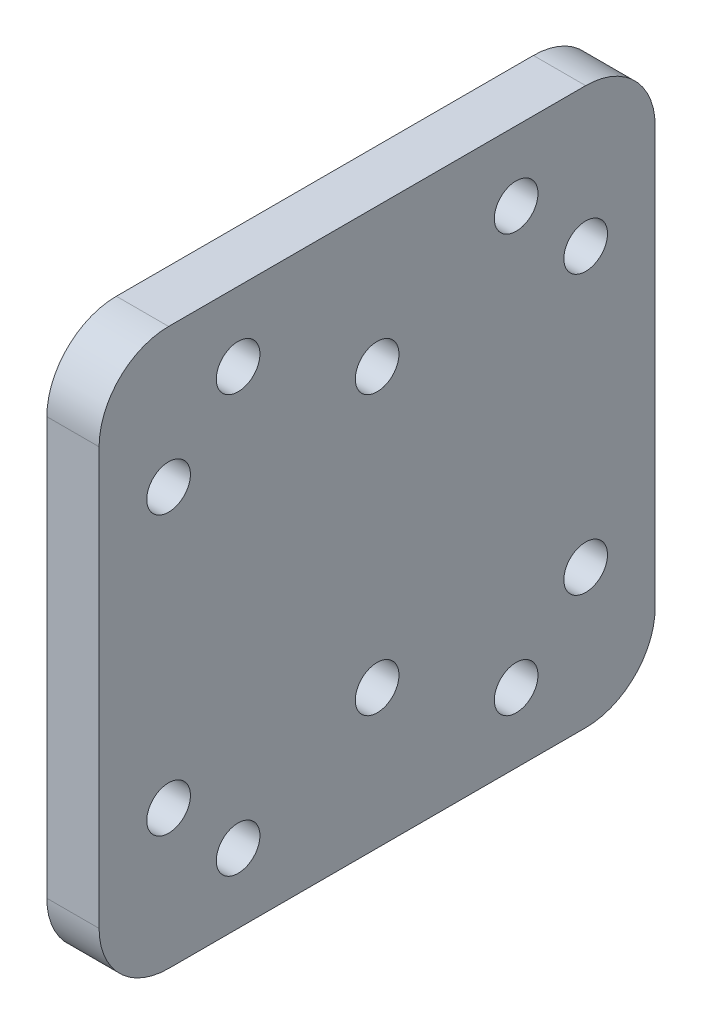
ISO-10303-21;
HEADER;
FILE_DESCRIPTION(('STEP AP214'),'2;1');
FILE_NAME('part.step','',(''),(''),'','','');
FILE_SCHEMA(('AUTOMOTIVE_DESIGN { 1 0 10303 214 1 1 1 1 }'));
ENDSEC;
DATA;
#1=APPLICATION_CONTEXT('core data for automotive mechanical design processes');
#2=APPLICATION_PROTOCOL_DEFINITION('international standard','automotive_design',2000,#1);
#3=PRODUCT_CONTEXT('',#1,'mechanical');
#4=PRODUCT('Part','Part','',(#3));
#5=PRODUCT_RELATED_PRODUCT_CATEGORY('part','',(#4));
#6=PRODUCT_DEFINITION_FORMATION('','',#4);
#7=PRODUCT_DEFINITION_CONTEXT('part definition',#1,'design');
#8=PRODUCT_DEFINITION('design','',#6,#7);
#9=PRODUCT_DEFINITION_SHAPE('','',#8);
#10=(LENGTH_UNIT() NAMED_UNIT(*) SI_UNIT(.MILLI.,.METRE.));
#11=(NAMED_UNIT(*) PLANE_ANGLE_UNIT() SI_UNIT($,.RADIAN.));
#12=(NAMED_UNIT(*) SI_UNIT($,.STERADIAN.) SOLID_ANGLE_UNIT());
#13=UNCERTAINTY_MEASURE_WITH_UNIT(LENGTH_MEASURE(1.E-05),#10,'distance_accuracy_value','');
#14=(GEOMETRIC_REPRESENTATION_CONTEXT(3) GLOBAL_UNCERTAINTY_ASSIGNED_CONTEXT((#13)) GLOBAL_UNIT_ASSIGNED_CONTEXT((#10,
#11,#12)) REPRESENTATION_CONTEXT('',''));
#15=CARTESIAN_POINT('',(0.,0.,0.));
#16=DIRECTION('',(0.,0.,1.));
#17=DIRECTION('',(1.,0.,0.));
#18=AXIS2_PLACEMENT_3D('',#15,#16,#17);
#19=CARTESIAN_POINT('',(0.,0.,-50.8));
#20=DIRECTION('',(0.,0.,-1.));
#21=DIRECTION('',(-1.,0.,0.));
#22=AXIS2_PLACEMENT_3D('',#19,#20,#21);
#23=PLANE('',#22);
#24=DIRECTION('',(1.,0.,0.));
#25=VECTOR('',#24,1.);
#26=CARTESIAN_POINT('',(2.3876,12.7,-50.8));
#27=LINE('',#26,#25);
#28=CARTESIAN_POINT('',(0.,12.7,-50.8));
#29=VERTEX_POINT('',#28);
#30=CARTESIAN_POINT('',(4.7752,12.7,-50.8));
#31=VERTEX_POINT('',#30);
#32=EDGE_CURVE('E211',#29,#31,#27,.T.);
#33=ORIENTED_EDGE('',*,*,#32,.F.);
#34=DIRECTION('',(0.,1.,0.));
#35=VECTOR('',#34,1.);
#36=CARTESIAN_POINT('',(0.,0.,-50.8));
#37=LINE('',#36,#35);
#38=CARTESIAN_POINT('',(0.,50.8,-50.8));
#39=VERTEX_POINT('',#38);
#40=EDGE_CURVE('E208',#29,#39,#37,.T.);
#41=ORIENTED_EDGE('',*,*,#40,.T.);
#42=DIRECTION('',(-1.,0.,0.));
#43=VECTOR('',#42,1.);
#44=CARTESIAN_POINT('',(2.3876,50.8,-50.8));
#45=LINE('',#44,#43);
#46=CARTESIAN_POINT('',(4.7752,50.8,-50.8));
#47=VERTEX_POINT('',#46);
#48=EDGE_CURVE('E321',#47,#39,#45,.T.);
#49=ORIENTED_EDGE('',*,*,#48,.F.);
#50=DIRECTION('',(0.,1.,0.));
#51=VECTOR('',#50,1.);
#52=CARTESIAN_POINT('',(4.7752,0.,-50.8));
#53=LINE('',#52,#51);
#54=EDGE_CURVE('E194',#31,#47,#53,.T.);
#55=ORIENTED_EDGE('',*,*,#54,.F.);
#56=EDGE_LOOP('',(#33,#41,#49,#55));
#57=FACE_BOUND('',#56,.T.);
#58=ADVANCED_FACE('F17',(#57),#23,.T.);
#59=CARTESIAN_POINT('',(0.,44.45,-25.4));
#60=DIRECTION('',(1.,0.,0.));
#61=DIRECTION('',(0.,-1.,0.));
#62=AXIS2_PLACEMENT_3D('',#59,#60,#61);
#63=CYLINDRICAL_SURFACE('',#62,1.9939);
#64=CARTESIAN_POINT('',(4.7752,44.45,-25.4));
#65=DIRECTION('',(-1.,0.,0.));
#66=DIRECTION('',(0.,-1.,0.));
#67=AXIS2_PLACEMENT_3D('',#64,#65,#66);
#68=CIRCLE('',#67,1.9939);
#69=CARTESIAN_POINT('',(4.7752,46.4439,-25.4));
#70=VERTEX_POINT('',#69);
#71=EDGE_CURVE('E278',#70,#70,#68,.T.);
#72=ORIENTED_EDGE('',*,*,#71,.F.);
#73=DIRECTION('',(-1.,0.,0.));
#74=VECTOR('',#73,1.);
#75=CARTESIAN_POINT('',(0.,46.4439,-25.4));
#76=LINE('',#75,#74);
#77=CARTESIAN_POINT('',(0.,46.4439,-25.4));
#78=VERTEX_POINT('',#77);
#79=EDGE_CURVE('E11',#70,#78,#76,.T.);
#80=ORIENTED_EDGE('',*,*,#79,.T.);
#81=CARTESIAN_POINT('',(0.,44.45,-25.4));
#82=DIRECTION('',(-1.,0.,0.));
#83=DIRECTION('',(0.,-1.,0.));
#84=AXIS2_PLACEMENT_3D('',#81,#82,#83);
#85=CIRCLE('',#84,1.9939);
#86=EDGE_CURVE('E282',#78,#78,#85,.T.);
#87=ORIENTED_EDGE('',*,*,#86,.T.);
#88=ORIENTED_EDGE('',*,*,#79,.F.);
#89=EDGE_LOOP('',(#72,#80,#87,#88));
#90=FACE_BOUND('',#89,.T.);
#91=ADVANCED_FACE('F582',(#90),#63,.F.);
#92=CARTESIAN_POINT('',(0.,44.45,-44.45));
#93=DIRECTION('',(1.,0.,0.));
#94=DIRECTION('',(0.,-1.,0.));
#95=AXIS2_PLACEMENT_3D('',#92,#93,#94);
#96=CYLINDRICAL_SURFACE('',#95,1.9939);
#97=CARTESIAN_POINT('',(4.7752,44.45,-44.45));
#98=DIRECTION('',(-1.,0.,0.));
#99=DIRECTION('',(0.,-1.,0.));
#100=AXIS2_PLACEMENT_3D('',#97,#98,#99);
#101=CIRCLE('',#100,1.9939);
#102=CARTESIAN_POINT('',(4.7752,46.4439,-44.45));
#103=VERTEX_POINT('',#102);
#104=EDGE_CURVE('E243',#103,#103,#101,.T.);
#105=ORIENTED_EDGE('',*,*,#104,.F.);
#106=DIRECTION('',(-1.,0.,0.));
#107=VECTOR('',#106,1.);
#108=CARTESIAN_POINT('',(0.,46.4439,-44.45));
#109=LINE('',#108,#107);
#110=CARTESIAN_POINT('',(0.,46.4439,-44.45));
#111=VERTEX_POINT('',#110);
#112=EDGE_CURVE('E25',#103,#111,#109,.T.);
#113=ORIENTED_EDGE('',*,*,#112,.T.);
#114=CARTESIAN_POINT('',(0.,44.45,-44.45));
#115=DIRECTION('',(-1.,0.,0.));
#116=DIRECTION('',(0.,-1.,0.));
#117=AXIS2_PLACEMENT_3D('',#114,#115,#116);
#118=CIRCLE('',#117,1.9939);
#119=EDGE_CURVE('E279',#111,#111,#118,.T.);
#120=ORIENTED_EDGE('',*,*,#119,.T.);
#121=ORIENTED_EDGE('',*,*,#112,.F.);
#122=EDGE_LOOP('',(#105,#113,#120,#121));
#123=FACE_BOUND('',#122,.T.);
#124=ADVANCED_FACE('F587',(#123),#96,.F.);
#125=CARTESIAN_POINT('',(0.,19.05,-44.45));
#126=DIRECTION('',(1.,0.,0.));
#127=DIRECTION('',(0.,-1.,0.));
#128=AXIS2_PLACEMENT_3D('',#125,#126,#127);
#129=CYLINDRICAL_SURFACE('',#128,1.9939);
#130=CARTESIAN_POINT('',(4.7752,19.05,-44.45));
#131=DIRECTION('',(-1.,0.,0.));
#132=DIRECTION('',(0.,-1.,0.));
#133=AXIS2_PLACEMENT_3D('',#130,#131,#132);
#134=CIRCLE('',#133,1.9939);
#135=CARTESIAN_POINT('',(4.7752,21.0439,-44.45));
#136=VERTEX_POINT('',#135);
#137=EDGE_CURVE('E238',#136,#136,#134,.T.);
#138=ORIENTED_EDGE('',*,*,#137,.F.);
#139=DIRECTION('',(-1.,0.,0.));
#140=VECTOR('',#139,1.);
#141=CARTESIAN_POINT('',(0.,21.0439,-44.45));
#142=LINE('',#141,#140);
#143=CARTESIAN_POINT('',(0.,21.0439,-44.45));
#144=VERTEX_POINT('',#143);
#145=EDGE_CURVE('E381',#136,#144,#142,.T.);
#146=ORIENTED_EDGE('',*,*,#145,.T.);
#147=CARTESIAN_POINT('',(0.,19.05,-44.45));
#148=DIRECTION('',(-1.,0.,0.));
#149=DIRECTION('',(0.,-1.,0.));
#150=AXIS2_PLACEMENT_3D('',#147,#148,#149);
#151=CIRCLE('',#150,1.9939);
#152=EDGE_CURVE('E283',#144,#144,#151,.T.);
#153=ORIENTED_EDGE('',*,*,#152,.T.);
#154=ORIENTED_EDGE('',*,*,#145,.F.);
#155=EDGE_LOOP('',(#138,#146,#153,#154));
#156=FACE_BOUND('',#155,.T.);
#157=ADVANCED_FACE('F592',(#156),#129,.F.);
#158=CARTESIAN_POINT('',(0.,44.45,-6.35));
#159=DIRECTION('',(1.,0.,0.));
#160=DIRECTION('',(0.,-1.,0.));
#161=AXIS2_PLACEMENT_3D('',#158,#159,#160);
#162=CYLINDRICAL_SURFACE('',#161,1.9939);
#163=CARTESIAN_POINT('',(4.7752,44.45,-6.35));
#164=DIRECTION('',(-1.,0.,0.));
#165=DIRECTION('',(0.,-1.,0.));
#166=AXIS2_PLACEMENT_3D('',#163,#164,#165);
#167=CIRCLE('',#166,1.9939);
#168=CARTESIAN_POINT('',(4.7752,46.4439,-6.35));
#169=VERTEX_POINT('',#168);
#170=EDGE_CURVE('E242',#169,#169,#167,.T.);
#171=ORIENTED_EDGE('',*,*,#170,.F.);
#172=DIRECTION('',(-1.,0.,0.));
#173=VECTOR('',#172,1.);
#174=CARTESIAN_POINT('',(0.,46.4439,-6.35));
#175=LINE('',#174,#173);
#176=CARTESIAN_POINT('',(0.,46.4439,-6.35));
#177=VERTEX_POINT('',#176);
#178=EDGE_CURVE('E378',#169,#177,#175,.T.);
#179=ORIENTED_EDGE('',*,*,#178,.T.);
#180=CARTESIAN_POINT('',(0.,44.45,-6.35));
#181=DIRECTION('',(-1.,0.,0.));
#182=DIRECTION('',(0.,-1.,0.));
#183=AXIS2_PLACEMENT_3D('',#180,#181,#182);
#184=CIRCLE('',#183,1.9939);
#185=EDGE_CURVE('E363',#177,#177,#184,.T.);
#186=ORIENTED_EDGE('',*,*,#185,.T.);
#187=ORIENTED_EDGE('',*,*,#178,.F.);
#188=EDGE_LOOP('',(#171,#179,#186,#187));
#189=FACE_BOUND('',#188,.T.);
#190=ADVANCED_FACE('F596',(#189),#162,.F.);
#191=CARTESIAN_POINT('',(0.,19.05,-6.35));
#192=DIRECTION('',(1.,0.,0.));
#193=DIRECTION('',(0.,-1.,0.));
#194=AXIS2_PLACEMENT_3D('',#191,#192,#193);
#195=CYLINDRICAL_SURFACE('',#194,1.9939);
#196=CARTESIAN_POINT('',(4.7752,19.05,-6.35));
#197=DIRECTION('',(-1.,0.,0.));
#198=DIRECTION('',(0.,-1.,0.));
#199=AXIS2_PLACEMENT_3D('',#196,#197,#198);
#200=CIRCLE('',#199,1.9939);
#201=CARTESIAN_POINT('',(4.7752,21.0439,-6.35));
#202=VERTEX_POINT('',#201);
#203=EDGE_CURVE('E298',#202,#202,#200,.T.);
#204=ORIENTED_EDGE('',*,*,#203,.F.);
#205=DIRECTION('',(-1.,0.,0.));
#206=VECTOR('',#205,1.);
#207=CARTESIAN_POINT('',(0.,21.0439,-6.35));
#208=LINE('',#207,#206);
#209=CARTESIAN_POINT('',(0.,21.0439,-6.35));
#210=VERTEX_POINT('',#209);
#211=EDGE_CURVE('E293',#202,#210,#208,.T.);
#212=ORIENTED_EDGE('',*,*,#211,.T.);
#213=CARTESIAN_POINT('',(0.,19.05,-6.35));
#214=DIRECTION('',(-1.,0.,0.));
#215=DIRECTION('',(0.,-1.,0.));
#216=AXIS2_PLACEMENT_3D('',#213,#214,#215);
#217=CIRCLE('',#216,1.9939);
#218=EDGE_CURVE('E337',#210,#210,#217,.T.);
#219=ORIENTED_EDGE('',*,*,#218,.T.);
#220=ORIENTED_EDGE('',*,*,#211,.F.);
#221=EDGE_LOOP('',(#204,#212,#219,#220));
#222=FACE_BOUND('',#221,.T.);
#223=ADVANCED_FACE('F602',(#222),#195,.F.);
#224=CARTESIAN_POINT('',(0.,50.8,-38.1));
#225=DIRECTION('',(1.,0.,0.));
#226=DIRECTION('',(0.,-1.,0.));
#227=AXIS2_PLACEMENT_3D('',#224,#225,#226);
#228=CYLINDRICAL_SURFACE('',#227,1.9939);
#229=CARTESIAN_POINT('',(4.7752,50.8,-38.1));
#230=DIRECTION('',(-1.,0.,0.));
#231=DIRECTION('',(0.,-1.,0.));
#232=AXIS2_PLACEMENT_3D('',#229,#230,#231);
#233=CIRCLE('',#232,1.9939);
#234=CARTESIAN_POINT('',(4.7752,52.7939,-38.1));
#235=VERTEX_POINT('',#234);
#236=EDGE_CURVE('E302',#235,#235,#233,.T.);
#237=ORIENTED_EDGE('',*,*,#236,.F.);
#238=DIRECTION('',(-1.,0.,0.));
#239=VECTOR('',#238,1.);
#240=CARTESIAN_POINT('',(0.,52.7939,-38.1));
#241=LINE('',#240,#239);
#242=CARTESIAN_POINT('',(0.,52.7939,-38.1));
#243=VERTEX_POINT('',#242);
#244=EDGE_CURVE('E290',#235,#243,#241,.T.);
#245=ORIENTED_EDGE('',*,*,#244,.T.);
#246=CARTESIAN_POINT('',(0.,50.8,-38.1));
#247=DIRECTION('',(-1.,0.,0.));
#248=DIRECTION('',(0.,-1.,0.));
#249=AXIS2_PLACEMENT_3D('',#246,#247,#248);
#250=CIRCLE('',#249,1.9939);
#251=EDGE_CURVE('E333',#243,#243,#250,.T.);
#252=ORIENTED_EDGE('',*,*,#251,.T.);
#253=ORIENTED_EDGE('',*,*,#244,.F.);
#254=EDGE_LOOP('',(#237,#245,#252,#253));
#255=FACE_BOUND('',#254,.T.);
#256=ADVANCED_FACE('F598',(#255),#228,.F.);
#257=CARTESIAN_POINT('',(0.,12.7,-38.1));
#258=DIRECTION('',(1.,0.,0.));
#259=DIRECTION('',(0.,-1.,0.));
#260=AXIS2_PLACEMENT_3D('',#257,#258,#259);
#261=CYLINDRICAL_SURFACE('',#260,1.9939);
#262=CARTESIAN_POINT('',(4.7752,12.7,-38.1));
#263=DIRECTION('',(-1.,0.,0.));
#264=DIRECTION('',(0.,-1.,0.));
#265=AXIS2_PLACEMENT_3D('',#262,#263,#264);
#266=CIRCLE('',#265,1.9939);
#267=CARTESIAN_POINT('',(4.7752,14.6939,-38.1));
#268=VERTEX_POINT('',#267);
#269=EDGE_CURVE('E311',#268,#268,#266,.T.);
#270=ORIENTED_EDGE('',*,*,#269,.F.);
#271=DIRECTION('',(-1.,0.,0.));
#272=VECTOR('',#271,1.);
#273=CARTESIAN_POINT('',(0.,14.6939,-38.1));
#274=LINE('',#273,#272);
#275=CARTESIAN_POINT('',(0.,14.6939,-38.1));
#276=VERTEX_POINT('',#275);
#277=EDGE_CURVE('E294',#268,#276,#274,.T.);
#278=ORIENTED_EDGE('',*,*,#277,.T.);
#279=CARTESIAN_POINT('',(0.,12.7,-38.1));
#280=DIRECTION('',(-1.,0.,0.));
#281=DIRECTION('',(0.,-1.,0.));
#282=AXIS2_PLACEMENT_3D('',#279,#280,#281);
#283=CIRCLE('',#282,1.9939);
#284=EDGE_CURVE('E338',#276,#276,#283,.T.);
#285=ORIENTED_EDGE('',*,*,#284,.T.);
#286=ORIENTED_EDGE('',*,*,#277,.F.);
#287=EDGE_LOOP('',(#270,#278,#285,#286));
#288=FACE_BOUND('',#287,.T.);
#289=ADVANCED_FACE('F601',(#288),#261,.F.);
#290=CARTESIAN_POINT('',(0.,50.8,-12.7));
#291=DIRECTION('',(1.,0.,0.));
#292=DIRECTION('',(0.,-1.,0.));
#293=AXIS2_PLACEMENT_3D('',#290,#291,#292);
#294=CYLINDRICAL_SURFACE('',#293,1.9939);
#295=CARTESIAN_POINT('',(4.7752,50.8,-12.7));
#296=DIRECTION('',(-1.,0.,0.));
#297=DIRECTION('',(0.,-1.,0.));
#298=AXIS2_PLACEMENT_3D('',#295,#296,#297);
#299=CIRCLE('',#298,1.9939);
#300=CARTESIAN_POINT('',(4.7752,52.7939,-12.7));
#301=VERTEX_POINT('',#300);
#302=EDGE_CURVE('E273',#301,#301,#299,.T.);
#303=ORIENTED_EDGE('',*,*,#302,.F.);
#304=DIRECTION('',(-1.,0.,0.));
#305=VECTOR('',#304,1.);
#306=CARTESIAN_POINT('',(0.,52.7939,-12.7));
#307=LINE('',#306,#305);
#308=CARTESIAN_POINT('',(0.,52.7939,-12.7));
#309=VERTEX_POINT('',#308);
#310=EDGE_CURVE('E267',#301,#309,#307,.T.);
#311=ORIENTED_EDGE('',*,*,#310,.T.);
#312=CARTESIAN_POINT('',(0.,50.8,-12.7));
#313=DIRECTION('',(-1.,0.,0.));
#314=DIRECTION('',(0.,-1.,0.));
#315=AXIS2_PLACEMENT_3D('',#312,#313,#314);
#316=CIRCLE('',#315,1.9939);
#317=EDGE_CURVE('E307',#309,#309,#316,.T.);
#318=ORIENTED_EDGE('',*,*,#317,.T.);
#319=ORIENTED_EDGE('',*,*,#310,.F.);
#320=EDGE_LOOP('',(#303,#311,#318,#319));
#321=FACE_BOUND('',#320,.T.);
#322=ADVANCED_FACE('F606',(#321),#294,.F.);
#323=CARTESIAN_POINT('',(0.,12.7,-12.7));
#324=DIRECTION('',(1.,0.,0.));
#325=DIRECTION('',(0.,-1.,0.));
#326=AXIS2_PLACEMENT_3D('',#323,#324,#325);
#327=CYLINDRICAL_SURFACE('',#326,1.9939);
#328=CARTESIAN_POINT('',(4.7752,12.7,-12.7));
#329=DIRECTION('',(-1.,0.,0.));
#330=DIRECTION('',(0.,-1.,0.));
#331=AXIS2_PLACEMENT_3D('',#328,#329,#330);
#332=CIRCLE('',#331,1.9939);
#333=CARTESIAN_POINT('',(4.7752,14.6939,-12.7));
#334=VERTEX_POINT('',#333);
#335=EDGE_CURVE('E268',#334,#334,#332,.T.);
#336=ORIENTED_EDGE('',*,*,#335,.F.);
#337=DIRECTION('',(-1.,0.,0.));
#338=VECTOR('',#337,1.);
#339=CARTESIAN_POINT('',(0.,14.6939,-12.7));
#340=LINE('',#339,#338);
#341=CARTESIAN_POINT('',(0.,14.6939,-12.7));
#342=VERTEX_POINT('',#341);
#343=EDGE_CURVE('E264',#334,#342,#340,.T.);
#344=ORIENTED_EDGE('',*,*,#343,.T.);
#345=CARTESIAN_POINT('',(0.,12.7,-12.7));
#346=DIRECTION('',(-1.,0.,0.));
#347=DIRECTION('',(0.,-1.,0.));
#348=AXIS2_PLACEMENT_3D('',#345,#346,#347);
#349=CIRCLE('',#348,1.9939);
#350=EDGE_CURVE('E303',#342,#342,#349,.T.);
#351=ORIENTED_EDGE('',*,*,#350,.T.);
#352=ORIENTED_EDGE('',*,*,#343,.F.);
#353=EDGE_LOOP('',(#336,#344,#351,#352));
#354=FACE_BOUND('',#353,.T.);
#355=ADVANCED_FACE('F613',(#354),#327,.F.);
#356=CARTESIAN_POINT('',(0.,19.05,-25.4));
#357=DIRECTION('',(1.,0.,0.));
#358=DIRECTION('',(0.,-1.,0.));
#359=AXIS2_PLACEMENT_3D('',#356,#357,#358);
#360=CYLINDRICAL_SURFACE('',#359,1.9939);
#361=CARTESIAN_POINT('',(4.7752,19.05,-25.4));
#362=DIRECTION('',(-1.,0.,0.));
#363=DIRECTION('',(0.,-1.,0.));
#364=AXIS2_PLACEMENT_3D('',#361,#362,#363);
#365=CIRCLE('',#364,1.9939);
#366=CARTESIAN_POINT('',(4.7752,21.0439,-25.4));
#367=VERTEX_POINT('',#366);
#368=EDGE_CURVE('E272',#367,#367,#365,.T.);
#369=ORIENTED_EDGE('',*,*,#368,.F.);
#370=DIRECTION('',(-1.,0.,0.));
#371=VECTOR('',#370,1.);
#372=CARTESIAN_POINT('',(0.,21.0439,-25.4));
#373=LINE('',#372,#371);
#374=CARTESIAN_POINT('',(0.,21.0439,-25.4));
#375=VERTEX_POINT('',#374);
#376=EDGE_CURVE('E219',#367,#375,#373,.T.);
#377=ORIENTED_EDGE('',*,*,#376,.T.);
#378=CARTESIAN_POINT('',(0.,19.05,-25.4));
#379=DIRECTION('',(-1.,0.,0.));
#380=DIRECTION('',(0.,-1.,0.));
#381=AXIS2_PLACEMENT_3D('',#378,#379,#380);
#382=CIRCLE('',#381,1.9939);
#383=EDGE_CURVE('E236',#375,#375,#382,.T.);
#384=ORIENTED_EDGE('',*,*,#383,.T.);
#385=ORIENTED_EDGE('',*,*,#376,.F.);
#386=EDGE_LOOP('',(#369,#377,#384,#385));
#387=FACE_BOUND('',#386,.T.);
#388=ADVANCED_FACE('F615',(#387),#360,.F.);
#389=CARTESIAN_POINT('',(0.,63.5,0.));
#390=DIRECTION('',(0.,0.,1.));
#391=DIRECTION('',(0.,-1.,0.));
#392=AXIS2_PLACEMENT_3D('',#389,#390,#391);
#393=PLANE('',#392);
#394=DIRECTION('',(1.,0.,0.));
#395=VECTOR('',#394,1.);
#396=CARTESIAN_POINT('',(2.3876,50.8,0.));
#397=LINE('',#396,#395);
#398=CARTESIAN_POINT('',(0.,50.8,0.));
#399=VERTEX_POINT('',#398);
#400=CARTESIAN_POINT('',(4.7752,50.8,0.));
#401=VERTEX_POINT('',#400);
#402=EDGE_CURVE('E227',#399,#401,#397,.T.);
#403=ORIENTED_EDGE('',*,*,#402,.F.);
#404=DIRECTION('',(0.,-1.,0.));
#405=VECTOR('',#404,1.);
#406=CARTESIAN_POINT('',(0.,63.5,0.));
#407=LINE('',#406,#405);
#408=CARTESIAN_POINT('',(0.,12.7,0.));
#409=VERTEX_POINT('',#408);
#410=EDGE_CURVE('E237',#399,#409,#407,.T.);
#411=ORIENTED_EDGE('',*,*,#410,.T.);
#412=DIRECTION('',(-1.,0.,0.));
#413=VECTOR('',#412,1.);
#414=CARTESIAN_POINT('',(2.3876,12.7,0.));
#415=LINE('',#414,#413);
#416=CARTESIAN_POINT('',(4.7752,12.7,0.));
#417=VERTEX_POINT('',#416);
#418=EDGE_CURVE('E255',#417,#409,#415,.T.);
#419=ORIENTED_EDGE('',*,*,#418,.F.);
#420=DIRECTION('',(0.,-1.,0.));
#421=VECTOR('',#420,1.);
#422=CARTESIAN_POINT('',(4.7752,63.5,0.));
#423=LINE('',#422,#421);
#424=EDGE_CURVE('E263',#401,#417,#423,.T.);
#425=ORIENTED_EDGE('',*,*,#424,.F.);
#426=EDGE_LOOP('',(#403,#411,#419,#425));
#427=FACE_BOUND('',#426,.T.);
#428=ADVANCED_FACE('F556',(#427),#393,.T.);
#429=CARTESIAN_POINT('',(0.,31.75,-25.4));
#430=DIRECTION('',(1.,0.,0.));
#431=DIRECTION('',(0.,1.,0.));
#432=AXIS2_PLACEMENT_3D('',#429,#430,#431);
#433=PLANE('',#432);
#434=ORIENTED_EDGE('',*,*,#86,.F.);
#435=EDGE_LOOP('',(#434));
#436=FACE_BOUND('',#435,.T.);
#437=ORIENTED_EDGE('',*,*,#119,.F.);
#438=EDGE_LOOP('',(#437));
#439=FACE_BOUND('',#438,.T.);
#440=ORIENTED_EDGE('',*,*,#152,.F.);
#441=EDGE_LOOP('',(#440));
#442=FACE_BOUND('',#441,.T.);
#443=ORIENTED_EDGE('',*,*,#185,.F.);
#444=EDGE_LOOP('',(#443));
#445=FACE_BOUND('',#444,.T.);
#446=ORIENTED_EDGE('',*,*,#218,.F.);
#447=EDGE_LOOP('',(#446));
#448=FACE_BOUND('',#447,.T.);
#449=ORIENTED_EDGE('',*,*,#251,.F.);
#450=EDGE_LOOP('',(#449));
#451=FACE_BOUND('',#450,.T.);
#452=ORIENTED_EDGE('',*,*,#284,.F.);
#453=EDGE_LOOP('',(#452));
#454=FACE_BOUND('',#453,.T.);
#455=ORIENTED_EDGE('',*,*,#317,.F.);
#456=EDGE_LOOP('',(#455));
#457=FACE_BOUND('',#456,.T.);
#458=ORIENTED_EDGE('',*,*,#350,.F.);
#459=EDGE_LOOP('',(#458));
#460=FACE_BOUND('',#459,.T.);
#461=ORIENTED_EDGE('',*,*,#383,.F.);
#462=EDGE_LOOP('',(#461));
#463=FACE_BOUND('',#462,.T.);
#464=CARTESIAN_POINT('',(0.,12.7,-44.45));
#465=DIRECTION('',(1.,0.,0.));
#466=DIRECTION('',(0.,-0.707106781186547,-0.707106781186548));
#467=AXIS2_PLACEMENT_3D('',#464,#465,#466);
#468=CIRCLE('',#467,6.35);
#469=CARTESIAN_POINT('',(0.,6.35,-44.45));
#470=VERTEX_POINT('',#469);
#471=EDGE_CURVE('E200',#470,#29,#468,.T.);
#472=ORIENTED_EDGE('',*,*,#471,.F.);
#473=DIRECTION('',(0.,0.,1.));
#474=VECTOR('',#473,1.);
#475=CARTESIAN_POINT('',(0.,6.35,-12.7));
#476=LINE('',#475,#474);
#477=CARTESIAN_POINT('',(0.,6.35,-6.35));
#478=VERTEX_POINT('',#477);
#479=EDGE_CURVE('E182',#470,#478,#476,.T.);
#480=ORIENTED_EDGE('',*,*,#479,.T.);
#481=CARTESIAN_POINT('',(0.,12.7,-6.35));
#482=DIRECTION('',(1.,0.,0.));
#483=DIRECTION('',(0.,-0.707106781186547,0.707106781186548));
#484=AXIS2_PLACEMENT_3D('',#481,#482,#483);
#485=CIRCLE('',#484,6.35);
#486=EDGE_CURVE('E252',#409,#478,#485,.T.);
#487=ORIENTED_EDGE('',*,*,#486,.F.);
#488=ORIENTED_EDGE('',*,*,#410,.F.);
#489=CARTESIAN_POINT('',(0.,50.8,-6.35));
#490=DIRECTION('',(1.,0.,0.));
#491=DIRECTION('',(0.,0.707106781186547,0.707106781186548));
#492=AXIS2_PLACEMENT_3D('',#489,#490,#491);
#493=CIRCLE('',#492,6.35);
#494=CARTESIAN_POINT('',(0.,57.15,-6.35));
#495=VERTEX_POINT('',#494);
#496=EDGE_CURVE('E224',#495,#399,#493,.T.);
#497=ORIENTED_EDGE('',*,*,#496,.F.);
#498=DIRECTION('',(0.,0.,-1.));
#499=VECTOR('',#498,1.);
#500=CARTESIAN_POINT('',(0.,57.15,-38.1));
#501=LINE('',#500,#499);
#502=CARTESIAN_POINT('',(0.,57.15,-44.45));
#503=VERTEX_POINT('',#502);
#504=EDGE_CURVE('E332',#495,#503,#501,.T.);
#505=ORIENTED_EDGE('',*,*,#504,.T.);
#506=CARTESIAN_POINT('',(0.,50.8,-44.45));
#507=DIRECTION('',(1.,0.,0.));
#508=DIRECTION('',(0.,0.707106781186548,-0.707106781186548));
#509=AXIS2_PLACEMENT_3D('',#506,#507,#508);
#510=CIRCLE('',#509,6.35);
#511=EDGE_CURVE('E325',#39,#503,#510,.T.);
#512=ORIENTED_EDGE('',*,*,#511,.F.);
#513=ORIENTED_EDGE('',*,*,#40,.F.);
#514=EDGE_LOOP('',(#472,#480,#487,#488,#497,#505,#512,#513));
#515=FACE_BOUND('',#514,.T.);
#516=ADVANCED_FACE('F206',(#436,#439,#442,#445,#448,#451,#454,#457,#460,#463,#515),#433,.F.);
#517=CARTESIAN_POINT('',(2.3876,12.7,-6.35));
#518=DIRECTION('',(1.,0.,0.));
#519=DIRECTION('',(0.,-0.707106781186547,0.707106781186548));
#520=AXIS2_PLACEMENT_3D('',#517,#518,#519);
#521=CYLINDRICAL_SURFACE('',#520,6.35);
#522=CARTESIAN_POINT('',(4.7752,12.7,-6.35));
#523=DIRECTION('',(-1.,0.,0.));
#524=DIRECTION('',(0.,-0.707106781186547,0.707106781186548));
#525=AXIS2_PLACEMENT_3D('',#522,#523,#524);
#526=CIRCLE('',#525,6.35);
#527=CARTESIAN_POINT('',(4.7752,6.35,-6.35));
#528=VERTEX_POINT('',#527);
#529=EDGE_CURVE('E274',#528,#417,#526,.T.);
#530=ORIENTED_EDGE('',*,*,#529,.T.);
#531=ORIENTED_EDGE('',*,*,#418,.T.);
#532=ORIENTED_EDGE('',*,*,#486,.T.);
#533=DIRECTION('',(1.,0.,0.));
#534=VECTOR('',#533,1.);
#535=CARTESIAN_POINT('',(2.3876,6.35,-6.35));
#536=LINE('',#535,#534);
#537=EDGE_CURVE('E189',#478,#528,#536,.T.);
#538=ORIENTED_EDGE('',*,*,#537,.T.);
#539=EDGE_LOOP('',(#530,#531,#532,#538));
#540=FACE_BOUND('',#539,.T.);
#541=ADVANCED_FACE('F558',(#540),#521,.T.);
#542=CARTESIAN_POINT('',(2.3876,50.8,-6.35));
#543=DIRECTION('',(-1.,0.,0.));
#544=DIRECTION('',(0.,0.707106781186547,0.707106781186548));
#545=AXIS2_PLACEMENT_3D('',#542,#543,#544);
#546=CYLINDRICAL_SURFACE('',#545,6.35);
#547=ORIENTED_EDGE('',*,*,#496,.T.);
#548=ORIENTED_EDGE('',*,*,#402,.T.);
#549=CARTESIAN_POINT('',(4.7752,50.8,-6.35));
#550=DIRECTION('',(-1.,0.,0.));
#551=DIRECTION('',(0.,0.707106781186547,0.707106781186548));
#552=AXIS2_PLACEMENT_3D('',#549,#550,#551);
#553=CIRCLE('',#552,6.35);
#554=CARTESIAN_POINT('',(4.7752,57.15,-6.35));
#555=VERTEX_POINT('',#554);
#556=EDGE_CURVE('E259',#401,#555,#553,.T.);
#557=ORIENTED_EDGE('',*,*,#556,.T.);
#558=DIRECTION('',(-1.,0.,0.));
#559=VECTOR('',#558,1.);
#560=CARTESIAN_POINT('',(2.3876,57.15,-6.35));
#561=LINE('',#560,#559);
#562=EDGE_CURVE('E228',#555,#495,#561,.T.);
#563=ORIENTED_EDGE('',*,*,#562,.T.);
#564=EDGE_LOOP('',(#547,#548,#557,#563));
#565=FACE_BOUND('',#564,.T.);
#566=ADVANCED_FACE('F569',(#565),#546,.T.);
#567=CARTESIAN_POINT('',(4.7752,57.15,-50.8));
#568=DIRECTION('',(0.,-1.,0.));
#569=DIRECTION('',(0.,0.,-1.));
#570=AXIS2_PLACEMENT_3D('',#567,#568,#569);
#571=PLANE('',#570);
#572=DIRECTION('',(1.,0.,0.));
#573=VECTOR('',#572,1.);
#574=CARTESIAN_POINT('',(2.3876,57.15,-44.45));
#575=LINE('',#574,#573);
#576=CARTESIAN_POINT('',(4.7752,57.15,-44.45));
#577=VERTEX_POINT('',#576);
#578=EDGE_CURVE('E329',#503,#577,#575,.T.);
#579=ORIENTED_EDGE('',*,*,#578,.F.);
#580=ORIENTED_EDGE('',*,*,#504,.F.);
#581=ORIENTED_EDGE('',*,*,#562,.F.);
#582=DIRECTION('',(0.,0.,1.));
#583=VECTOR('',#582,1.);
#584=CARTESIAN_POINT('',(4.7752,57.15,-38.1));
#585=LINE('',#584,#583);
#586=EDGE_CURVE('E247',#577,#555,#585,.T.);
#587=ORIENTED_EDGE('',*,*,#586,.F.);
#588=EDGE_LOOP('',(#579,#580,#581,#587));
#589=FACE_BOUND('',#588,.T.);
#590=ADVANCED_FACE('F566',(#589),#571,.F.);
#591=CARTESIAN_POINT('',(2.3876,50.8,-44.45));
#592=DIRECTION('',(1.,0.,0.));
#593=DIRECTION('',(0.,0.707106781186548,-0.707106781186548));
#594=AXIS2_PLACEMENT_3D('',#591,#592,#593);
#595=CYLINDRICAL_SURFACE('',#594,6.35);
#596=CARTESIAN_POINT('',(4.7752,50.8,-44.45));
#597=DIRECTION('',(-1.,0.,0.));
#598=DIRECTION('',(0.,0.707106781186548,-0.707106781186548));
#599=AXIS2_PLACEMENT_3D('',#596,#597,#598);
#600=CIRCLE('',#599,6.35);
#601=EDGE_CURVE('E244',#577,#47,#600,.T.);
#602=ORIENTED_EDGE('',*,*,#601,.T.);
#603=ORIENTED_EDGE('',*,*,#48,.T.);
#604=ORIENTED_EDGE('',*,*,#511,.T.);
#605=ORIENTED_EDGE('',*,*,#578,.T.);
#606=EDGE_LOOP('',(#602,#603,#604,#605));
#607=FACE_BOUND('',#606,.T.);
#608=ADVANCED_FACE('F562',(#607),#595,.T.);
#609=CARTESIAN_POINT('',(4.7752,31.75,-25.4));
#610=DIRECTION('',(1.,0.,0.));
#611=DIRECTION('',(0.,1.,0.));
#612=AXIS2_PLACEMENT_3D('',#609,#610,#611);
#613=PLANE('',#612);
#614=ORIENTED_EDGE('',*,*,#368,.T.);
#615=EDGE_LOOP('',(#614));
#616=FACE_BOUND('',#615,.T.);
#617=ORIENTED_EDGE('',*,*,#335,.T.);
#618=EDGE_LOOP('',(#617));
#619=FACE_BOUND('',#618,.T.);
#620=ORIENTED_EDGE('',*,*,#302,.T.);
#621=EDGE_LOOP('',(#620));
#622=FACE_BOUND('',#621,.T.);
#623=ORIENTED_EDGE('',*,*,#269,.T.);
#624=EDGE_LOOP('',(#623));
#625=FACE_BOUND('',#624,.T.);
#626=ORIENTED_EDGE('',*,*,#236,.T.);
#627=EDGE_LOOP('',(#626));
#628=FACE_BOUND('',#627,.T.);
#629=ORIENTED_EDGE('',*,*,#203,.T.);
#630=EDGE_LOOP('',(#629));
#631=FACE_BOUND('',#630,.T.);
#632=ORIENTED_EDGE('',*,*,#170,.T.);
#633=EDGE_LOOP('',(#632));
#634=FACE_BOUND('',#633,.T.);
#635=ORIENTED_EDGE('',*,*,#137,.T.);
#636=EDGE_LOOP('',(#635));
#637=FACE_BOUND('',#636,.T.);
#638=ORIENTED_EDGE('',*,*,#104,.T.);
#639=EDGE_LOOP('',(#638));
#640=FACE_BOUND('',#639,.T.);
#641=ORIENTED_EDGE('',*,*,#71,.T.);
#642=EDGE_LOOP('',(#641));
#643=FACE_BOUND('',#642,.T.);
#644=CARTESIAN_POINT('',(4.7752,12.7,-44.45));
#645=DIRECTION('',(-1.,0.,0.));
#646=DIRECTION('',(0.,-0.707106781186547,-0.707106781186548));
#647=AXIS2_PLACEMENT_3D('',#644,#645,#646);
#648=CIRCLE('',#647,6.35);
#649=CARTESIAN_POINT('',(4.7752,6.35,-44.45));
#650=VERTEX_POINT('',#649);
#651=EDGE_CURVE('E202',#31,#650,#648,.T.);
#652=ORIENTED_EDGE('',*,*,#651,.F.);
#653=ORIENTED_EDGE('',*,*,#54,.T.);
#654=ORIENTED_EDGE('',*,*,#601,.F.);
#655=ORIENTED_EDGE('',*,*,#586,.T.);
#656=ORIENTED_EDGE('',*,*,#556,.F.);
#657=ORIENTED_EDGE('',*,*,#424,.T.);
#658=ORIENTED_EDGE('',*,*,#529,.F.);
#659=DIRECTION('',(0.,0.,-1.));
#660=VECTOR('',#659,1.);
#661=CARTESIAN_POINT('',(4.7752,6.35,-12.7));
#662=LINE('',#661,#660);
#663=EDGE_CURVE('E204',#528,#650,#662,.T.);
#664=ORIENTED_EDGE('',*,*,#663,.T.);
#665=EDGE_LOOP('',(#652,#653,#654,#655,#656,#657,#658,#664));
#666=FACE_BOUND('',#665,.T.);
#667=ADVANCED_FACE('F553',(#616,#619,#622,#625,#628,#631,#634,#637,#640,#643,#666),#613,.T.);
#668=CARTESIAN_POINT('',(4.7752,6.35,0.));
#669=DIRECTION('',(0.,1.,0.));
#670=DIRECTION('',(0.,0.,-1.));
#671=AXIS2_PLACEMENT_3D('',#668,#669,#670);
#672=PLANE('',#671);
#673=DIRECTION('',(-1.,0.,0.));
#674=VECTOR('',#673,1.);
#675=CARTESIAN_POINT('',(2.3876,6.35,-44.45));
#676=LINE('',#675,#674);
#677=EDGE_CURVE('E186',#650,#470,#676,.T.);
#678=ORIENTED_EDGE('',*,*,#677,.F.);
#679=ORIENTED_EDGE('',*,*,#663,.F.);
#680=ORIENTED_EDGE('',*,*,#537,.F.);
#681=ORIENTED_EDGE('',*,*,#479,.F.);
#682=EDGE_LOOP('',(#678,#679,#680,#681));
#683=FACE_BOUND('',#682,.T.);
#684=ADVANCED_FACE('F184',(#683),#672,.F.);
#685=CARTESIAN_POINT('',(2.3876,12.7,-44.45));
#686=DIRECTION('',(-1.,0.,0.));
#687=DIRECTION('',(0.,-0.707106781186547,-0.707106781186548));
#688=AXIS2_PLACEMENT_3D('',#685,#686,#687);
#689=CYLINDRICAL_SURFACE('',#688,6.35);
#690=ORIENTED_EDGE('',*,*,#471,.T.);
#691=ORIENTED_EDGE('',*,*,#32,.T.);
#692=ORIENTED_EDGE('',*,*,#651,.T.);
#693=ORIENTED_EDGE('',*,*,#677,.T.);
#694=EDGE_LOOP('',(#690,#691,#692,#693));
#695=FACE_BOUND('',#694,.T.);
#696=ADVANCED_FACE('F198',(#695),#689,.T.);
#697=CLOSED_SHELL('',(#58,#91,#124,#157,#190,#223,#256,#289,#322,#355,#388,#428,#516,#541,#566,
#590,#608,#667,#684,#696));
#698=MANIFOLD_SOLID_BREP('B1',#697);
#699=ADVANCED_BREP_SHAPE_REPRESENTATION('',(#18,#698),#14);
#700=SHAPE_DEFINITION_REPRESENTATION(#9,#699);
ENDSEC;
END-ISO-10303-21;
